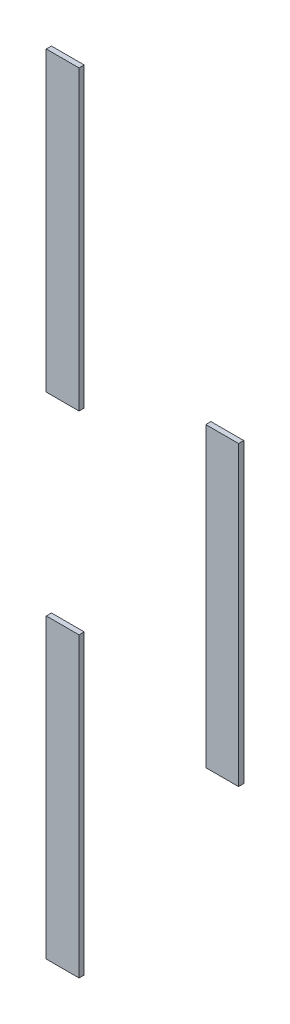
ISO-10303-21;
HEADER;
FILE_DESCRIPTION(('STEP AP214'),'2;1');
FILE_NAME('part.step','',(''),(''),'','','');
FILE_SCHEMA(('AUTOMOTIVE_DESIGN { 1 0 10303 214 1 1 1 1 }'));
ENDSEC;
DATA;
#1=APPLICATION_CONTEXT('core data for automotive mechanical design processes');
#2=APPLICATION_PROTOCOL_DEFINITION('international standard','automotive_design',2000,#1);
#3=PRODUCT_CONTEXT('',#1,'mechanical');
#4=PRODUCT('Part','Part','',(#3));
#5=PRODUCT_RELATED_PRODUCT_CATEGORY('part','',(#4));
#6=PRODUCT_DEFINITION_FORMATION('','',#4);
#7=PRODUCT_DEFINITION_CONTEXT('part definition',#1,'design');
#8=PRODUCT_DEFINITION('design','',#6,#7);
#9=PRODUCT_DEFINITION_SHAPE('','',#8);
#10=(LENGTH_UNIT() NAMED_UNIT(*) SI_UNIT(.MILLI.,.METRE.));
#11=(NAMED_UNIT(*) PLANE_ANGLE_UNIT() SI_UNIT($,.RADIAN.));
#12=(NAMED_UNIT(*) SI_UNIT($,.STERADIAN.) SOLID_ANGLE_UNIT());
#13=UNCERTAINTY_MEASURE_WITH_UNIT(LENGTH_MEASURE(1.E-05),#10,'distance_accuracy_value','');
#14=(GEOMETRIC_REPRESENTATION_CONTEXT(3) GLOBAL_UNCERTAINTY_ASSIGNED_CONTEXT((#13)) GLOBAL_UNIT_ASSIGNED_CONTEXT((#10,
#11,#12)) REPRESENTATION_CONTEXT('',''));
#15=CARTESIAN_POINT('',(0.,0.,0.));
#16=DIRECTION('',(0.,0.,1.));
#17=DIRECTION('',(1.,0.,0.));
#18=AXIS2_PLACEMENT_3D('',#15,#16,#17);
#19=CARTESIAN_POINT('',(-36.9281129180026,180.,2.));
#20=DIRECTION('',(1.,0.,0.));
#21=DIRECTION('',(0.,0.,-1.));
#22=AXIS2_PLACEMENT_3D('',#19,#20,#21);
#23=PLANE('',#22);
#24=DIRECTION('',(0.,-1.,0.));
#25=VECTOR('',#24,1.);
#26=CARTESIAN_POINT('',(-36.9281129180026,180.,0.));
#27=LINE('',#26,#25);
#28=CARTESIAN_POINT('',(-36.9281129180026,295.,0.));
#29=VERTEX_POINT('',#28);
#30=CARTESIAN_POINT('',(-36.9281129180026,180.,0.));
#31=VERTEX_POINT('',#30);
#32=EDGE_CURVE('E12',#29,#31,#27,.T.);
#33=ORIENTED_EDGE('',*,*,#32,.T.);
#34=DIRECTION('',(0.,0.,-1.));
#35=VECTOR('',#34,1.);
#36=CARTESIAN_POINT('',(-36.9281129180026,180.,2.));
#37=LINE('',#36,#35);
#38=CARTESIAN_POINT('',(-36.9281129180026,180.,2.));
#39=VERTEX_POINT('',#38);
#40=EDGE_CURVE('E119',#39,#31,#37,.T.);
#41=ORIENTED_EDGE('',*,*,#40,.F.);
#42=DIRECTION('',(0.,-1.,0.));
#43=VECTOR('',#42,1.);
#44=CARTESIAN_POINT('',(-36.9281129180026,180.,2.));
#45=LINE('',#44,#43);
#46=CARTESIAN_POINT('',(-36.9281129180026,295.,2.));
#47=VERTEX_POINT('',#46);
#48=EDGE_CURVE('E52',#47,#39,#45,.T.);
#49=ORIENTED_EDGE('',*,*,#48,.F.);
#50=DIRECTION('',(0.,0.,-1.));
#51=VECTOR('',#50,1.);
#52=CARTESIAN_POINT('',(-36.9281129180026,295.,2.));
#53=LINE('',#52,#51);
#54=EDGE_CURVE('E107',#47,#29,#53,.T.);
#55=ORIENTED_EDGE('',*,*,#54,.T.);
#56=EDGE_LOOP('',(#33,#41,#49,#55));
#57=FACE_BOUND('',#56,.T.);
#58=ADVANCED_FACE('F48',(#57),#23,.F.);
#59=CARTESIAN_POINT('',(-36.9281129180026,180.,2.));
#60=DIRECTION('',(0.,1.,0.));
#61=DIRECTION('',(0.,0.,1.));
#62=AXIS2_PLACEMENT_3D('',#59,#60,#61);
#63=PLANE('',#62);
#64=DIRECTION('',(1.,0.,0.));
#65=VECTOR('',#64,1.);
#66=CARTESIAN_POINT('',(-36.9281129180026,180.,0.));
#67=LINE('',#66,#65);
#68=CARTESIAN_POINT('',(-24.2281129180026,180.,0.));
#69=VERTEX_POINT('',#68);
#70=EDGE_CURVE('E58',#31,#69,#67,.T.);
#71=ORIENTED_EDGE('',*,*,#70,.T.);
#72=DIRECTION('',(0.,0.,-1.));
#73=VECTOR('',#72,1.);
#74=CARTESIAN_POINT('',(-24.2281129180026,180.,2.));
#75=LINE('',#74,#73);
#76=CARTESIAN_POINT('',(-24.2281129180026,180.,2.));
#77=VERTEX_POINT('',#76);
#78=EDGE_CURVE('E103',#77,#69,#75,.T.);
#79=ORIENTED_EDGE('',*,*,#78,.F.);
#80=DIRECTION('',(1.,0.,0.));
#81=VECTOR('',#80,1.);
#82=CARTESIAN_POINT('',(-36.9281129180026,180.,2.));
#83=LINE('',#82,#81);
#84=EDGE_CURVE('E82',#39,#77,#83,.T.);
#85=ORIENTED_EDGE('',*,*,#84,.F.);
#86=ORIENTED_EDGE('',*,*,#40,.T.);
#87=EDGE_LOOP('',(#71,#79,#85,#86));
#88=FACE_BOUND('',#87,.T.);
#89=ADVANCED_FACE('F122',(#88),#63,.F.);
#90=CARTESIAN_POINT('',(-24.2281129180026,180.,2.));
#91=DIRECTION('',(-1.,0.,0.));
#92=DIRECTION('',(0.,0.,1.));
#93=AXIS2_PLACEMENT_3D('',#90,#91,#92);
#94=PLANE('',#93);
#95=DIRECTION('',(0.,1.,0.));
#96=VECTOR('',#95,1.);
#97=CARTESIAN_POINT('',(-24.2281129180026,180.,0.));
#98=LINE('',#97,#96);
#99=CARTESIAN_POINT('',(-24.2281129180026,295.,0.));
#100=VERTEX_POINT('',#99);
#101=EDGE_CURVE('E98',#69,#100,#98,.T.);
#102=ORIENTED_EDGE('',*,*,#101,.T.);
#103=DIRECTION('',(0.,0.,-1.));
#104=VECTOR('',#103,1.);
#105=CARTESIAN_POINT('',(-24.2281129180026,295.,2.));
#106=LINE('',#105,#104);
#107=CARTESIAN_POINT('',(-24.2281129180026,295.,2.));
#108=VERTEX_POINT('',#107);
#109=EDGE_CURVE('E101',#108,#100,#106,.T.);
#110=ORIENTED_EDGE('',*,*,#109,.F.);
#111=DIRECTION('',(0.,1.,0.));
#112=VECTOR('',#111,1.);
#113=CARTESIAN_POINT('',(-24.2281129180026,180.,2.));
#114=LINE('',#113,#112);
#115=EDGE_CURVE('E115',#77,#108,#114,.T.);
#116=ORIENTED_EDGE('',*,*,#115,.F.);
#117=ORIENTED_EDGE('',*,*,#78,.T.);
#118=EDGE_LOOP('',(#102,#110,#116,#117));
#119=FACE_BOUND('',#118,.T.);
#120=ADVANCED_FACE('F99',(#119),#94,.F.);
#121=CARTESIAN_POINT('',(-36.9281129180026,295.,2.));
#122=DIRECTION('',(0.,-1.,0.));
#123=DIRECTION('',(0.,0.,-1.));
#124=AXIS2_PLACEMENT_3D('',#121,#122,#123);
#125=PLANE('',#124);
#126=DIRECTION('',(-1.,0.,0.));
#127=VECTOR('',#126,1.);
#128=CARTESIAN_POINT('',(-36.9281129180026,295.,0.));
#129=LINE('',#128,#127);
#130=EDGE_CURVE('E92',#100,#29,#129,.T.);
#131=ORIENTED_EDGE('',*,*,#130,.T.);
#132=ORIENTED_EDGE('',*,*,#54,.F.);
#133=DIRECTION('',(-1.,0.,0.));
#134=VECTOR('',#133,1.);
#135=CARTESIAN_POINT('',(-36.9281129180026,295.,2.));
#136=LINE('',#135,#134);
#137=EDGE_CURVE('E106',#108,#47,#136,.T.);
#138=ORIENTED_EDGE('',*,*,#137,.F.);
#139=ORIENTED_EDGE('',*,*,#109,.T.);
#140=EDGE_LOOP('',(#131,#132,#138,#139));
#141=FACE_BOUND('',#140,.T.);
#142=ADVANCED_FACE('F105',(#141),#125,.F.);
#143=CARTESIAN_POINT('',(0.,0.,2.));
#144=DIRECTION('',(0.,0.,-1.));
#145=DIRECTION('',(-1.,0.,0.));
#146=AXIS2_PLACEMENT_3D('',#143,#144,#145);
#147=PLANE('',#146);
#148=ORIENTED_EDGE('',*,*,#48,.T.);
#149=ORIENTED_EDGE('',*,*,#84,.T.);
#150=ORIENTED_EDGE('',*,*,#115,.T.);
#151=ORIENTED_EDGE('',*,*,#137,.T.);
#152=EDGE_LOOP('',(#148,#149,#150,#151));
#153=FACE_BOUND('',#152,.T.);
#154=ADVANCED_FACE('F50',(#153),#147,.F.);
#155=CARTESIAN_POINT('',(0.,0.,0.));
#156=DIRECTION('',(0.,0.,-1.));
#157=DIRECTION('',(-1.,0.,0.));
#158=AXIS2_PLACEMENT_3D('',#155,#156,#157);
#159=PLANE('',#158);
#160=ORIENTED_EDGE('',*,*,#32,.F.);
#161=ORIENTED_EDGE('',*,*,#130,.F.);
#162=ORIENTED_EDGE('',*,*,#101,.F.);
#163=ORIENTED_EDGE('',*,*,#70,.F.);
#164=EDGE_LOOP('',(#160,#161,#162,#163));
#165=FACE_BOUND('',#164,.T.);
#166=ADVANCED_FACE('F109',(#165),#159,.T.);
#167=CLOSED_SHELL('',(#58,#89,#120,#142,#154,#166));
#168=MANIFOLD_SOLID_BREP('B2',#167);
#169=CARTESIAN_POINT('',(24.803379131132,85.,2.));
#170=DIRECTION('',(1.,0.,0.));
#171=DIRECTION('',(0.,0.,-1.));
#172=AXIS2_PLACEMENT_3D('',#169,#170,#171);
#173=PLANE('',#172);
#174=DIRECTION('',(0.,-1.,0.));
#175=VECTOR('',#174,1.);
#176=CARTESIAN_POINT('',(24.803379131132,85.,0.));
#177=LINE('',#176,#175);
#178=CARTESIAN_POINT('',(24.803379131132,200.,0.));
#179=VERTEX_POINT('',#178);
#180=CARTESIAN_POINT('',(24.803379131132,85.,0.));
#181=VERTEX_POINT('',#180);
#182=EDGE_CURVE('E46',#179,#181,#177,.T.);
#183=ORIENTED_EDGE('',*,*,#182,.T.);
#184=DIRECTION('',(0.,0.,-1.));
#185=VECTOR('',#184,1.);
#186=CARTESIAN_POINT('',(24.803379131132,85.,2.));
#187=LINE('',#186,#185);
#188=CARTESIAN_POINT('',(24.803379131132,85.,2.));
#189=VERTEX_POINT('',#188);
#190=EDGE_CURVE('E264',#189,#181,#187,.T.);
#191=ORIENTED_EDGE('',*,*,#190,.F.);
#192=DIRECTION('',(0.,-1.,0.));
#193=VECTOR('',#192,1.);
#194=CARTESIAN_POINT('',(24.803379131132,85.,2.));
#195=LINE('',#194,#193);
#196=CARTESIAN_POINT('',(24.803379131132,200.,2.));
#197=VERTEX_POINT('',#196);
#198=EDGE_CURVE('E197',#197,#189,#195,.T.);
#199=ORIENTED_EDGE('',*,*,#198,.F.);
#200=DIRECTION('',(0.,0.,-1.));
#201=VECTOR('',#200,1.);
#202=CARTESIAN_POINT('',(24.803379131132,200.,2.));
#203=LINE('',#202,#201);
#204=EDGE_CURVE('E252',#197,#179,#203,.T.);
#205=ORIENTED_EDGE('',*,*,#204,.T.);
#206=EDGE_LOOP('',(#183,#191,#199,#205));
#207=FACE_BOUND('',#206,.T.);
#208=ADVANCED_FACE('F193',(#207),#173,.F.);
#209=CARTESIAN_POINT('',(24.803379131132,85.,2.));
#210=DIRECTION('',(0.,1.,0.));
#211=DIRECTION('',(0.,0.,1.));
#212=AXIS2_PLACEMENT_3D('',#209,#210,#211);
#213=PLANE('',#212);
#214=DIRECTION('',(1.,0.,0.));
#215=VECTOR('',#214,1.);
#216=CARTESIAN_POINT('',(24.803379131132,85.,0.));
#217=LINE('',#216,#215);
#218=CARTESIAN_POINT('',(37.503379131132,85.,0.));
#219=VERTEX_POINT('',#218);
#220=EDGE_CURVE('E203',#181,#219,#217,.T.);
#221=ORIENTED_EDGE('',*,*,#220,.T.);
#222=DIRECTION('',(0.,0.,-1.));
#223=VECTOR('',#222,1.);
#224=CARTESIAN_POINT('',(37.503379131132,85.,2.));
#225=LINE('',#224,#223);
#226=CARTESIAN_POINT('',(37.503379131132,85.,2.));
#227=VERTEX_POINT('',#226);
#228=EDGE_CURVE('E248',#227,#219,#225,.T.);
#229=ORIENTED_EDGE('',*,*,#228,.F.);
#230=DIRECTION('',(1.,0.,0.));
#231=VECTOR('',#230,1.);
#232=CARTESIAN_POINT('',(24.803379131132,85.,2.));
#233=LINE('',#232,#231);
#234=EDGE_CURVE('E227',#189,#227,#233,.T.);
#235=ORIENTED_EDGE('',*,*,#234,.F.);
#236=ORIENTED_EDGE('',*,*,#190,.T.);
#237=EDGE_LOOP('',(#221,#229,#235,#236));
#238=FACE_BOUND('',#237,.T.);
#239=ADVANCED_FACE('F267',(#238),#213,.F.);
#240=CARTESIAN_POINT('',(37.503379131132,85.,2.));
#241=DIRECTION('',(-1.,0.,0.));
#242=DIRECTION('',(0.,0.,1.));
#243=AXIS2_PLACEMENT_3D('',#240,#241,#242);
#244=PLANE('',#243);
#245=DIRECTION('',(0.,1.,0.));
#246=VECTOR('',#245,1.);
#247=CARTESIAN_POINT('',(37.503379131132,85.,0.));
#248=LINE('',#247,#246);
#249=CARTESIAN_POINT('',(37.503379131132,200.,0.));
#250=VERTEX_POINT('',#249);
#251=EDGE_CURVE('E243',#219,#250,#248,.T.);
#252=ORIENTED_EDGE('',*,*,#251,.T.);
#253=DIRECTION('',(0.,0.,-1.));
#254=VECTOR('',#253,1.);
#255=CARTESIAN_POINT('',(37.503379131132,200.,2.));
#256=LINE('',#255,#254);
#257=CARTESIAN_POINT('',(37.503379131132,200.,2.));
#258=VERTEX_POINT('',#257);
#259=EDGE_CURVE('E246',#258,#250,#256,.T.);
#260=ORIENTED_EDGE('',*,*,#259,.F.);
#261=DIRECTION('',(0.,1.,0.));
#262=VECTOR('',#261,1.);
#263=CARTESIAN_POINT('',(37.503379131132,85.,2.));
#264=LINE('',#263,#262);
#265=EDGE_CURVE('E260',#227,#258,#264,.T.);
#266=ORIENTED_EDGE('',*,*,#265,.F.);
#267=ORIENTED_EDGE('',*,*,#228,.T.);
#268=EDGE_LOOP('',(#252,#260,#266,#267));
#269=FACE_BOUND('',#268,.T.);
#270=ADVANCED_FACE('F244',(#269),#244,.F.);
#271=CARTESIAN_POINT('',(24.803379131132,200.,2.));
#272=DIRECTION('',(0.,-1.,0.));
#273=DIRECTION('',(0.,0.,-1.));
#274=AXIS2_PLACEMENT_3D('',#271,#272,#273);
#275=PLANE('',#274);
#276=DIRECTION('',(-1.,0.,0.));
#277=VECTOR('',#276,1.);
#278=CARTESIAN_POINT('',(24.803379131132,200.,0.));
#279=LINE('',#278,#277);
#280=EDGE_CURVE('E237',#250,#179,#279,.T.);
#281=ORIENTED_EDGE('',*,*,#280,.T.);
#282=ORIENTED_EDGE('',*,*,#204,.F.);
#283=DIRECTION('',(-1.,0.,0.));
#284=VECTOR('',#283,1.);
#285=CARTESIAN_POINT('',(24.803379131132,200.,2.));
#286=LINE('',#285,#284);
#287=EDGE_CURVE('E251',#258,#197,#286,.T.);
#288=ORIENTED_EDGE('',*,*,#287,.F.);
#289=ORIENTED_EDGE('',*,*,#259,.T.);
#290=EDGE_LOOP('',(#281,#282,#288,#289));
#291=FACE_BOUND('',#290,.T.);
#292=ADVANCED_FACE('F250',(#291),#275,.F.);
#293=CARTESIAN_POINT('',(0.,0.,2.));
#294=DIRECTION('',(0.,0.,-1.));
#295=DIRECTION('',(-1.,0.,0.));
#296=AXIS2_PLACEMENT_3D('',#293,#294,#295);
#297=PLANE('',#296);
#298=ORIENTED_EDGE('',*,*,#198,.T.);
#299=ORIENTED_EDGE('',*,*,#234,.T.);
#300=ORIENTED_EDGE('',*,*,#265,.T.);
#301=ORIENTED_EDGE('',*,*,#287,.T.);
#302=EDGE_LOOP('',(#298,#299,#300,#301));
#303=FACE_BOUND('',#302,.T.);
#304=ADVANCED_FACE('F195',(#303),#297,.F.);
#305=CARTESIAN_POINT('',(0.,0.,0.));
#306=DIRECTION('',(0.,0.,-1.));
#307=DIRECTION('',(-1.,0.,0.));
#308=AXIS2_PLACEMENT_3D('',#305,#306,#307);
#309=PLANE('',#308);
#310=ORIENTED_EDGE('',*,*,#182,.F.);
#311=ORIENTED_EDGE('',*,*,#280,.F.);
#312=ORIENTED_EDGE('',*,*,#251,.F.);
#313=ORIENTED_EDGE('',*,*,#220,.F.);
#314=EDGE_LOOP('',(#310,#311,#312,#313));
#315=FACE_BOUND('',#314,.T.);
#316=ADVANCED_FACE('F254',(#315),#309,.T.);
#317=CLOSED_SHELL('',(#208,#239,#270,#292,#304,#316));
#318=MANIFOLD_SOLID_BREP('B6',#317);
#319=CARTESIAN_POINT('',(-36.9281129180039,-10.,2.));
#320=DIRECTION('',(1.,0.,0.));
#321=DIRECTION('',(0.,0.,-1.));
#322=AXIS2_PLACEMENT_3D('',#319,#320,#321);
#323=PLANE('',#322);
#324=DIRECTION('',(0.,-1.,0.));
#325=VECTOR('',#324,1.);
#326=CARTESIAN_POINT('',(-36.9281129180039,-10.,0.));
#327=LINE('',#326,#325);
#328=CARTESIAN_POINT('',(-36.9281129180039,105.,0.));
#329=VERTEX_POINT('',#328);
#330=CARTESIAN_POINT('',(-36.9281129180039,-10.,0.));
#331=VERTEX_POINT('',#330);
#332=EDGE_CURVE('E392',#329,#331,#327,.T.);
#333=ORIENTED_EDGE('',*,*,#332,.T.);
#334=DIRECTION('',(0.,0.,-1.));
#335=VECTOR('',#334,1.);
#336=CARTESIAN_POINT('',(-36.9281129180039,-10.,2.));
#337=LINE('',#336,#335);
#338=CARTESIAN_POINT('',(-36.9281129180039,-10.,2.));
#339=VERTEX_POINT('',#338);
#340=EDGE_CURVE('E191',#339,#331,#337,.T.);
#341=ORIENTED_EDGE('',*,*,#340,.F.);
#342=DIRECTION('',(0.,-1.,0.));
#343=VECTOR('',#342,1.);
#344=CARTESIAN_POINT('',(-36.9281129180039,-10.,2.));
#345=LINE('',#344,#343);
#346=CARTESIAN_POINT('',(-36.9281129180039,105.,2.));
#347=VERTEX_POINT('',#346);
#348=EDGE_CURVE('E380',#347,#339,#345,.T.);
#349=ORIENTED_EDGE('',*,*,#348,.F.);
#350=DIRECTION('',(0.,0.,-1.));
#351=VECTOR('',#350,1.);
#352=CARTESIAN_POINT('',(-36.9281129180039,105.,2.));
#353=LINE('',#352,#351);
#354=EDGE_CURVE('E388',#347,#329,#353,.T.);
#355=ORIENTED_EDGE('',*,*,#354,.T.);
#356=EDGE_LOOP('',(#333,#341,#349,#355));
#357=FACE_BOUND('',#356,.T.);
#358=ADVANCED_FACE('F329',(#357),#323,.F.);
#359=CARTESIAN_POINT('',(-36.9281129180039,-10.,2.));
#360=DIRECTION('',(0.,1.,0.));
#361=DIRECTION('',(0.,0.,1.));
#362=AXIS2_PLACEMENT_3D('',#359,#360,#361);
#363=PLANE('',#362);
#364=DIRECTION('',(1.,0.,0.));
#365=VECTOR('',#364,1.);
#366=CARTESIAN_POINT('',(-36.9281129180039,-10.,0.));
#367=LINE('',#366,#365);
#368=CARTESIAN_POINT('',(-24.2281129180039,-10.,0.));
#369=VERTEX_POINT('',#368);
#370=EDGE_CURVE('E384',#331,#369,#367,.T.);
#371=ORIENTED_EDGE('',*,*,#370,.T.);
#372=DIRECTION('',(0.,0.,-1.));
#373=VECTOR('',#372,1.);
#374=CARTESIAN_POINT('',(-24.2281129180039,-10.,2.));
#375=LINE('',#374,#373);
#376=CARTESIAN_POINT('',(-24.2281129180039,-10.,2.));
#377=VERTEX_POINT('',#376);
#378=EDGE_CURVE('E337',#377,#369,#375,.T.);
#379=ORIENTED_EDGE('',*,*,#378,.F.);
#380=DIRECTION('',(1.,0.,0.));
#381=VECTOR('',#380,1.);
#382=CARTESIAN_POINT('',(-36.9281129180039,-10.,2.));
#383=LINE('',#382,#381);
#384=EDGE_CURVE('E375',#339,#377,#383,.T.);
#385=ORIENTED_EDGE('',*,*,#384,.F.);
#386=ORIENTED_EDGE('',*,*,#340,.T.);
#387=EDGE_LOOP('',(#371,#379,#385,#386));
#388=FACE_BOUND('',#387,.T.);
#389=ADVANCED_FACE('F383',(#388),#363,.F.);
#390=CARTESIAN_POINT('',(-24.2281129180039,-10.,2.));
#391=DIRECTION('',(-1.,0.,0.));
#392=DIRECTION('',(0.,0.,1.));
#393=AXIS2_PLACEMENT_3D('',#390,#391,#392);
#394=PLANE('',#393);
#395=DIRECTION('',(0.,1.,0.));
#396=VECTOR('',#395,1.);
#397=CARTESIAN_POINT('',(-24.2281129180039,-10.,0.));
#398=LINE('',#397,#396);
#399=CARTESIAN_POINT('',(-24.2281129180039,105.,0.));
#400=VERTEX_POINT('',#399);
#401=EDGE_CURVE('E362',#369,#400,#398,.T.);
#402=ORIENTED_EDGE('',*,*,#401,.T.);
#403=DIRECTION('',(0.,0.,-1.));
#404=VECTOR('',#403,1.);
#405=CARTESIAN_POINT('',(-24.2281129180039,105.,2.));
#406=LINE('',#405,#404);
#407=CARTESIAN_POINT('',(-24.2281129180039,105.,2.));
#408=VERTEX_POINT('',#407);
#409=EDGE_CURVE('E385',#408,#400,#406,.T.);
#410=ORIENTED_EDGE('',*,*,#409,.F.);
#411=DIRECTION('',(0.,1.,0.));
#412=VECTOR('',#411,1.);
#413=CARTESIAN_POINT('',(-24.2281129180039,-10.,2.));
#414=LINE('',#413,#412);
#415=EDGE_CURVE('E378',#377,#408,#414,.T.);
#416=ORIENTED_EDGE('',*,*,#415,.F.);
#417=ORIENTED_EDGE('',*,*,#378,.T.);
#418=EDGE_LOOP('',(#402,#410,#416,#417));
#419=FACE_BOUND('',#418,.T.);
#420=ADVANCED_FACE('F386',(#419),#394,.F.);
#421=CARTESIAN_POINT('',(-36.9281129180039,105.,2.));
#422=DIRECTION('',(0.,-1.,0.));
#423=DIRECTION('',(0.,0.,-1.));
#424=AXIS2_PLACEMENT_3D('',#421,#422,#423);
#425=PLANE('',#424);
#426=DIRECTION('',(-1.,0.,0.));
#427=VECTOR('',#426,1.);
#428=CARTESIAN_POINT('',(-36.9281129180039,105.,0.));
#429=LINE('',#428,#427);
#430=EDGE_CURVE('E368',#400,#329,#429,.T.);
#431=ORIENTED_EDGE('',*,*,#430,.T.);
#432=ORIENTED_EDGE('',*,*,#354,.F.);
#433=DIRECTION('',(-1.,0.,0.));
#434=VECTOR('',#433,1.);
#435=CARTESIAN_POINT('',(-36.9281129180039,105.,2.));
#436=LINE('',#435,#434);
#437=EDGE_CURVE('E345',#408,#347,#436,.T.);
#438=ORIENTED_EDGE('',*,*,#437,.F.);
#439=ORIENTED_EDGE('',*,*,#409,.T.);
#440=EDGE_LOOP('',(#431,#432,#438,#439));
#441=FACE_BOUND('',#440,.T.);
#442=ADVANCED_FACE('F399',(#441),#425,.F.);
#443=CARTESIAN_POINT('',(0.,0.,2.));
#444=DIRECTION('',(0.,0.,-1.));
#445=DIRECTION('',(-1.,0.,0.));
#446=AXIS2_PLACEMENT_3D('',#443,#444,#445);
#447=PLANE('',#446);
#448=ORIENTED_EDGE('',*,*,#348,.T.);
#449=ORIENTED_EDGE('',*,*,#384,.T.);
#450=ORIENTED_EDGE('',*,*,#415,.T.);
#451=ORIENTED_EDGE('',*,*,#437,.T.);
#452=EDGE_LOOP('',(#448,#449,#450,#451));
#453=FACE_BOUND('',#452,.T.);
#454=ADVANCED_FACE('F376',(#453),#447,.F.);
#455=CARTESIAN_POINT('',(0.,0.,0.));
#456=DIRECTION('',(0.,0.,-1.));
#457=DIRECTION('',(-1.,0.,0.));
#458=AXIS2_PLACEMENT_3D('',#455,#456,#457);
#459=PLANE('',#458);
#460=ORIENTED_EDGE('',*,*,#332,.F.);
#461=ORIENTED_EDGE('',*,*,#430,.F.);
#462=ORIENTED_EDGE('',*,*,#401,.F.);
#463=ORIENTED_EDGE('',*,*,#370,.F.);
#464=EDGE_LOOP('',(#460,#461,#462,#463));
#465=FACE_BOUND('',#464,.T.);
#466=ADVANCED_FACE('F402',(#465),#459,.T.);
#467=CLOSED_SHELL('',(#358,#389,#420,#442,#454,#466));
#468=MANIFOLD_SOLID_BREP('B40',#467);
#469=ADVANCED_BREP_SHAPE_REPRESENTATION('',(#18,#168,#318,#468),#14);
#470=SHAPE_DEFINITION_REPRESENTATION(#9,#469);
ENDSEC;
END-ISO-10303-21;
